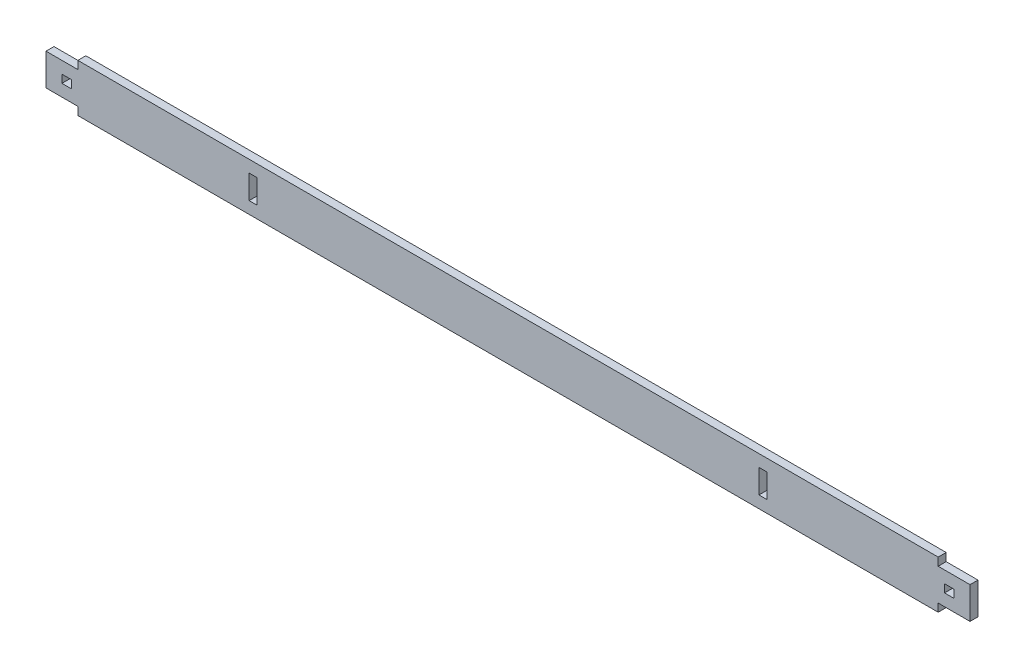
ISO-10303-21;
HEADER;
FILE_DESCRIPTION(('STEP AP214'),'2;1');
FILE_NAME('part.step','',(''),(''),'','','');
FILE_SCHEMA(('AUTOMOTIVE_DESIGN { 1 0 10303 214 1 1 1 1 }'));
ENDSEC;
DATA;
#1=APPLICATION_CONTEXT('core data for automotive mechanical design processes');
#2=APPLICATION_PROTOCOL_DEFINITION('international standard','automotive_design',2000,#1);
#3=PRODUCT_CONTEXT('',#1,'mechanical');
#4=PRODUCT('Part','Part','',(#3));
#5=PRODUCT_RELATED_PRODUCT_CATEGORY('part','',(#4));
#6=PRODUCT_DEFINITION_FORMATION('','',#4);
#7=PRODUCT_DEFINITION_CONTEXT('part definition',#1,'design');
#8=PRODUCT_DEFINITION('design','',#6,#7);
#9=PRODUCT_DEFINITION_SHAPE('','',#8);
#10=(LENGTH_UNIT() NAMED_UNIT(*) SI_UNIT(.MILLI.,.METRE.));
#11=(NAMED_UNIT(*) PLANE_ANGLE_UNIT() SI_UNIT($,.RADIAN.));
#12=(NAMED_UNIT(*) SI_UNIT($,.STERADIAN.) SOLID_ANGLE_UNIT());
#13=UNCERTAINTY_MEASURE_WITH_UNIT(LENGTH_MEASURE(1.E-05),#10,'distance_accuracy_value','');
#14=(GEOMETRIC_REPRESENTATION_CONTEXT(3) GLOBAL_UNCERTAINTY_ASSIGNED_CONTEXT((#13)) GLOBAL_UNIT_ASSIGNED_CONTEXT((#10,
#11,#12)) REPRESENTATION_CONTEXT('',''));
#15=CARTESIAN_POINT('',(0.,0.,0.));
#16=DIRECTION('',(0.,0.,1.));
#17=DIRECTION('',(1.,0.,0.));
#18=AXIS2_PLACEMENT_3D('',#15,#16,#17);
#19=CARTESIAN_POINT('',(0.,0.,6.35));
#20=DIRECTION('',(0.,0.,-1.));
#21=DIRECTION('',(-1.,0.,0.));
#22=AXIS2_PLACEMENT_3D('',#19,#20,#21);
#23=PLANE('',#22);
#24=DIRECTION('',(0.,-1.,0.));
#25=VECTOR('',#24,1.);
#26=CARTESIAN_POINT('',(355.6,3.175,6.35));
#27=LINE('',#26,#25);
#28=CARTESIAN_POINT('',(355.6,3.175,6.35));
#29=VERTEX_POINT('',#28);
#30=CARTESIAN_POINT('',(355.6,-3.175,6.35));
#31=VERTEX_POINT('',#30);
#32=EDGE_CURVE('E338',#29,#31,#27,.T.);
#33=ORIENTED_EDGE('',*,*,#32,.T.);
#34=DIRECTION('',(-1.,0.,0.));
#35=VECTOR('',#34,1.);
#36=CARTESIAN_POINT('',(355.6,-3.175,6.35));
#37=LINE('',#36,#35);
#38=CARTESIAN_POINT('',(347.98,-3.175,6.35));
#39=VERTEX_POINT('',#38);
#40=EDGE_CURVE('E352',#31,#39,#37,.T.);
#41=ORIENTED_EDGE('',*,*,#40,.T.);
#42=DIRECTION('',(0.,1.,0.));
#43=VECTOR('',#42,1.);
#44=CARTESIAN_POINT('',(347.98,3.175,6.35));
#45=LINE('',#44,#43);
#46=CARTESIAN_POINT('',(347.98,3.175,6.35));
#47=VERTEX_POINT('',#46);
#48=EDGE_CURVE('E370',#39,#47,#45,.T.);
#49=ORIENTED_EDGE('',*,*,#48,.T.);
#50=DIRECTION('',(1.,0.,0.));
#51=VECTOR('',#50,1.);
#52=CARTESIAN_POINT('',(355.6,3.175,6.35));
#53=LINE('',#52,#51);
#54=EDGE_CURVE('E366',#47,#29,#53,.T.);
#55=ORIENTED_EDGE('',*,*,#54,.T.);
#56=EDGE_LOOP('',(#33,#41,#49,#55));
#57=FACE_BOUND('',#56,.T.);
#58=DIRECTION('',(0.,1.,0.));
#59=VECTOR('',#58,1.);
#60=CARTESIAN_POINT('',(342.9,-19.05,6.35));
#61=LINE('',#60,#59);
#62=CARTESIAN_POINT('',(342.9,-19.05,6.35));
#63=VERTEX_POINT('',#62);
#64=CARTESIAN_POINT('',(342.9,-12.7,6.35));
#65=VERTEX_POINT('',#64);
#66=EDGE_CURVE('E486',#63,#65,#61,.T.);
#67=ORIENTED_EDGE('',*,*,#66,.T.);
#68=DIRECTION('',(-1.,0.,0.));
#69=VECTOR('',#68,1.);
#70=CARTESIAN_POINT('',(368.3,-12.7,6.35));
#71=LINE('',#70,#69);
#72=CARTESIAN_POINT('',(368.3,-12.7,6.35));
#73=VERTEX_POINT('',#72);
#74=EDGE_CURVE('E399',#73,#65,#71,.T.);
#75=ORIENTED_EDGE('',*,*,#74,.F.);
#76=DIRECTION('',(0.,-1.,0.));
#77=VECTOR('',#76,1.);
#78=CARTESIAN_POINT('',(368.3,-12.7,6.35));
#79=LINE('',#78,#77);
#80=CARTESIAN_POINT('',(368.3,12.7,6.35));
#81=VERTEX_POINT('',#80);
#82=EDGE_CURVE('E394',#81,#73,#79,.T.);
#83=ORIENTED_EDGE('',*,*,#82,.F.);
#84=DIRECTION('',(1.,0.,0.));
#85=VECTOR('',#84,1.);
#86=CARTESIAN_POINT('',(368.3,12.7,6.35));
#87=LINE('',#86,#85);
#88=CARTESIAN_POINT('',(342.9,12.7,6.35));
#89=VERTEX_POINT('',#88);
#90=EDGE_CURVE('E381',#89,#81,#87,.T.);
#91=ORIENTED_EDGE('',*,*,#90,.F.);
#92=CARTESIAN_POINT('',(342.9,19.05,6.35));
#93=VERTEX_POINT('',#92);
#94=EDGE_CURVE('E491',#89,#93,#61,.T.);
#95=ORIENTED_EDGE('',*,*,#94,.T.);
#96=DIRECTION('',(-1.,0.,0.));
#97=VECTOR('',#96,1.);
#98=CARTESIAN_POINT('',(-342.9,19.05,6.35));
#99=LINE('',#98,#97);
#100=CARTESIAN_POINT('',(-342.9,19.05,6.35));
#101=VERTEX_POINT('',#100);
#102=EDGE_CURVE('E490',#93,#101,#99,.T.);
#103=ORIENTED_EDGE('',*,*,#102,.T.);
#104=DIRECTION('',(0.,-1.,0.));
#105=VECTOR('',#104,1.);
#106=CARTESIAN_POINT('',(-342.9,-19.05,6.35));
#107=LINE('',#106,#105);
#108=CARTESIAN_POINT('',(-342.9,12.7,6.35));
#109=VERTEX_POINT('',#108);
#110=EDGE_CURVE('E495',#101,#109,#107,.T.);
#111=ORIENTED_EDGE('',*,*,#110,.T.);
#112=DIRECTION('',(-1.,0.,0.));
#113=VECTOR('',#112,1.);
#114=CARTESIAN_POINT('',(-368.3,12.7,6.35));
#115=LINE('',#114,#113);
#116=CARTESIAN_POINT('',(-368.3,12.7,6.35));
#117=VERTEX_POINT('',#116);
#118=EDGE_CURVE('E453',#109,#117,#115,.T.);
#119=ORIENTED_EDGE('',*,*,#118,.T.);
#120=DIRECTION('',(0.,-1.,0.));
#121=VECTOR('',#120,1.);
#122=CARTESIAN_POINT('',(-368.3,-12.7,6.35));
#123=LINE('',#122,#121);
#124=CARTESIAN_POINT('',(-368.3,-12.7,6.35));
#125=VERTEX_POINT('',#124);
#126=EDGE_CURVE('E464',#117,#125,#123,.T.);
#127=ORIENTED_EDGE('',*,*,#126,.T.);
#128=DIRECTION('',(1.,0.,0.));
#129=VECTOR('',#128,1.);
#130=CARTESIAN_POINT('',(-368.3,-12.7,6.35));
#131=LINE('',#130,#129);
#132=CARTESIAN_POINT('',(-342.9,-12.7,6.35));
#133=VERTEX_POINT('',#132);
#134=EDGE_CURVE('E460',#125,#133,#131,.T.);
#135=ORIENTED_EDGE('',*,*,#134,.T.);
#136=CARTESIAN_POINT('',(-342.9,-19.05,6.35));
#137=VERTEX_POINT('',#136);
#138=EDGE_CURVE('E494',#133,#137,#107,.T.);
#139=ORIENTED_EDGE('',*,*,#138,.T.);
#140=DIRECTION('',(1.,0.,0.));
#141=VECTOR('',#140,1.);
#142=CARTESIAN_POINT('',(-342.9,-19.05,6.35));
#143=LINE('',#142,#141);
#144=EDGE_CURVE('E498',#137,#63,#143,.T.);
#145=ORIENTED_EDGE('',*,*,#144,.T.);
#146=EDGE_LOOP('',(#67,#75,#83,#91,#95,#103,#111,#119,#127,#135,#139,#145));
#147=FACE_BOUND('',#146,.T.);
#148=DIRECTION('',(1.,0.,0.));
#149=VECTOR('',#148,1.);
#150=CARTESIAN_POINT('',(-355.6,-3.175,6.35));
#151=LINE('',#150,#149);
#152=CARTESIAN_POINT('',(-355.6,-3.175,6.35));
#153=VERTEX_POINT('',#152);
#154=CARTESIAN_POINT('',(-347.98,-3.175,6.35));
#155=VERTEX_POINT('',#154);
#156=EDGE_CURVE('E443',#153,#155,#151,.T.);
#157=ORIENTED_EDGE('',*,*,#156,.F.);
#158=DIRECTION('',(0.,-1.,0.));
#159=VECTOR('',#158,1.);
#160=CARTESIAN_POINT('',(-355.6,3.175,6.35));
#161=LINE('',#160,#159);
#162=CARTESIAN_POINT('',(-355.6,3.175,6.35));
#163=VERTEX_POINT('',#162);
#164=EDGE_CURVE('E427',#163,#153,#161,.T.);
#165=ORIENTED_EDGE('',*,*,#164,.F.);
#166=DIRECTION('',(-1.,0.,0.));
#167=VECTOR('',#166,1.);
#168=CARTESIAN_POINT('',(-355.6,3.175,6.35));
#169=LINE('',#168,#167);
#170=CARTESIAN_POINT('',(-347.98,3.175,6.35));
#171=VERTEX_POINT('',#170);
#172=EDGE_CURVE('E432',#171,#163,#169,.T.);
#173=ORIENTED_EDGE('',*,*,#172,.F.);
#174=DIRECTION('',(0.,1.,0.));
#175=VECTOR('',#174,1.);
#176=CARTESIAN_POINT('',(-347.98,3.175,6.35));
#177=LINE('',#176,#175);
#178=EDGE_CURVE('E446',#155,#171,#177,.T.);
#179=ORIENTED_EDGE('',*,*,#178,.F.);
#180=EDGE_LOOP('',(#157,#165,#173,#179));
#181=FACE_BOUND('',#180,.T.);
#182=DIRECTION('',(-1.,0.,0.));
#183=VECTOR('',#182,1.);
#184=CARTESIAN_POINT('',(-206.375,9.52500000000003,6.35));
#185=LINE('',#184,#183);
#186=CARTESIAN_POINT('',(-200.025,9.52500000000003,6.35));
#187=VERTEX_POINT('',#186);
#188=CARTESIAN_POINT('',(-206.375,9.52500000000003,6.35));
#189=VERTEX_POINT('',#188);
#190=EDGE_CURVE('E324',#187,#189,#185,.T.);
#191=ORIENTED_EDGE('',*,*,#190,.F.);
#192=DIRECTION('',(0.,1.,0.));
#193=VECTOR('',#192,1.);
#194=CARTESIAN_POINT('',(-200.025,9.52500000000003,6.35));
#195=LINE('',#194,#193);
#196=CARTESIAN_POINT('',(-200.025,-9.52499999999998,6.35));
#197=VERTEX_POINT('',#196);
#198=EDGE_CURVE('E298',#197,#187,#195,.T.);
#199=ORIENTED_EDGE('',*,*,#198,.F.);
#200=DIRECTION('',(1.,0.,0.));
#201=VECTOR('',#200,1.);
#202=CARTESIAN_POINT('',(-206.375,-9.52499999999998,6.35));
#203=LINE('',#202,#201);
#204=CARTESIAN_POINT('',(-206.375,-9.52499999999998,6.35));
#205=VERTEX_POINT('',#204);
#206=EDGE_CURVE('E309',#205,#197,#203,.T.);
#207=ORIENTED_EDGE('',*,*,#206,.F.);
#208=DIRECTION('',(0.,-1.,0.));
#209=VECTOR('',#208,1.);
#210=CARTESIAN_POINT('',(-206.375,9.52500000000003,6.35));
#211=LINE('',#210,#209);
#212=EDGE_CURVE('E328',#189,#205,#211,.T.);
#213=ORIENTED_EDGE('',*,*,#212,.F.);
#214=EDGE_LOOP('',(#191,#199,#207,#213));
#215=FACE_BOUND('',#214,.T.);
#216=DIRECTION('',(0.,1.,0.));
#217=VECTOR('',#216,1.);
#218=CARTESIAN_POINT('',(200.025,9.52500000000003,6.35));
#219=LINE('',#218,#217);
#220=CARTESIAN_POINT('',(200.025,-9.52499999999998,6.35));
#221=VERTEX_POINT('',#220);
#222=CARTESIAN_POINT('',(200.025,9.52500000000003,6.35));
#223=VERTEX_POINT('',#222);
#224=EDGE_CURVE('E57',#221,#223,#219,.T.);
#225=ORIENTED_EDGE('',*,*,#224,.T.);
#226=DIRECTION('',(1.,0.,0.));
#227=VECTOR('',#226,1.);
#228=CARTESIAN_POINT('',(206.375,9.52500000000003,6.35));
#229=LINE('',#228,#227);
#230=CARTESIAN_POINT('',(206.375,9.52500000000003,6.35));
#231=VERTEX_POINT('',#230);
#232=EDGE_CURVE('E277',#223,#231,#229,.T.);
#233=ORIENTED_EDGE('',*,*,#232,.T.);
#234=DIRECTION('',(0.,-1.,0.));
#235=VECTOR('',#234,1.);
#236=CARTESIAN_POINT('',(206.375,9.52500000000003,6.35));
#237=LINE('',#236,#235);
#238=CARTESIAN_POINT('',(206.375,-9.52499999999998,6.35));
#239=VERTEX_POINT('',#238);
#240=EDGE_CURVE('E281',#231,#239,#237,.T.);
#241=ORIENTED_EDGE('',*,*,#240,.T.);
#242=DIRECTION('',(-1.,0.,0.));
#243=VECTOR('',#242,1.);
#244=CARTESIAN_POINT('',(206.375,-9.52499999999998,6.35));
#245=LINE('',#244,#243);
#246=EDGE_CURVE('E289',#239,#221,#245,.T.);
#247=ORIENTED_EDGE('',*,*,#246,.T.);
#248=EDGE_LOOP('',(#225,#233,#241,#247));
#249=FACE_BOUND('',#248,.T.);
#250=ADVANCED_FACE('F38',(#57,#147,#181,#215,#249),#23,.F.);
#251=CARTESIAN_POINT('',(0.,0.,0.));
#252=DIRECTION('',(0.,0.,-1.));
#253=DIRECTION('',(-1.,0.,0.));
#254=AXIS2_PLACEMENT_3D('',#251,#252,#253);
#255=PLANE('',#254);
#256=DIRECTION('',(-1.,0.,0.));
#257=VECTOR('',#256,1.);
#258=CARTESIAN_POINT('',(355.6,-3.175,0.));
#259=LINE('',#258,#257);
#260=CARTESIAN_POINT('',(355.6,-3.175,0.));
#261=VERTEX_POINT('',#260);
#262=CARTESIAN_POINT('',(347.98,-3.175,0.));
#263=VERTEX_POINT('',#262);
#264=EDGE_CURVE('E359',#261,#263,#259,.T.);
#265=ORIENTED_EDGE('',*,*,#264,.F.);
#266=DIRECTION('',(0.,-1.,0.));
#267=VECTOR('',#266,1.);
#268=CARTESIAN_POINT('',(355.6,3.175,0.));
#269=LINE('',#268,#267);
#270=CARTESIAN_POINT('',(355.6,3.175,0.));
#271=VERTEX_POINT('',#270);
#272=EDGE_CURVE('E348',#271,#261,#269,.T.);
#273=ORIENTED_EDGE('',*,*,#272,.F.);
#274=DIRECTION('',(1.,0.,0.));
#275=VECTOR('',#274,1.);
#276=CARTESIAN_POINT('',(355.6,3.175,0.));
#277=LINE('',#276,#275);
#278=CARTESIAN_POINT('',(347.98,3.175,0.));
#279=VERTEX_POINT('',#278);
#280=EDGE_CURVE('E351',#279,#271,#277,.T.);
#281=ORIENTED_EDGE('',*,*,#280,.F.);
#282=DIRECTION('',(0.,1.,0.));
#283=VECTOR('',#282,1.);
#284=CARTESIAN_POINT('',(347.98,3.175,0.));
#285=LINE('',#284,#283);
#286=EDGE_CURVE('E355',#263,#279,#285,.T.);
#287=ORIENTED_EDGE('',*,*,#286,.F.);
#288=EDGE_LOOP('',(#265,#273,#281,#287));
#289=FACE_BOUND('',#288,.T.);
#290=DIRECTION('',(0.,1.,0.));
#291=VECTOR('',#290,1.);
#292=CARTESIAN_POINT('',(342.9,-19.05,0.));
#293=LINE('',#292,#291);
#294=CARTESIAN_POINT('',(342.9,12.7,0.));
#295=VERTEX_POINT('',#294);
#296=CARTESIAN_POINT('',(342.9,19.05,0.));
#297=VERTEX_POINT('',#296);
#298=EDGE_CURVE('E485',#295,#297,#293,.T.);
#299=ORIENTED_EDGE('',*,*,#298,.F.);
#300=DIRECTION('',(1.,0.,0.));
#301=VECTOR('',#300,1.);
#302=CARTESIAN_POINT('',(368.3,12.7,0.));
#303=LINE('',#302,#301);
#304=CARTESIAN_POINT('',(368.3,12.7,0.));
#305=VERTEX_POINT('',#304);
#306=EDGE_CURVE('E409',#295,#305,#303,.T.);
#307=ORIENTED_EDGE('',*,*,#306,.T.);
#308=DIRECTION('',(0.,-1.,0.));
#309=VECTOR('',#308,1.);
#310=CARTESIAN_POINT('',(368.3,-12.7,0.));
#311=LINE('',#310,#309);
#312=CARTESIAN_POINT('',(368.3,-12.7,0.));
#313=VERTEX_POINT('',#312);
#314=EDGE_CURVE('E404',#305,#313,#311,.T.);
#315=ORIENTED_EDGE('',*,*,#314,.T.);
#316=DIRECTION('',(-1.,0.,0.));
#317=VECTOR('',#316,1.);
#318=CARTESIAN_POINT('',(368.3,-12.7,0.));
#319=LINE('',#318,#317);
#320=CARTESIAN_POINT('',(342.9,-12.7,0.));
#321=VERTEX_POINT('',#320);
#322=EDGE_CURVE('E403',#313,#321,#319,.T.);
#323=ORIENTED_EDGE('',*,*,#322,.T.);
#324=CARTESIAN_POINT('',(342.9,-19.05,0.));
#325=VERTEX_POINT('',#324);
#326=EDGE_CURVE('E502',#325,#321,#293,.T.);
#327=ORIENTED_EDGE('',*,*,#326,.F.);
#328=DIRECTION('',(1.,0.,0.));
#329=VECTOR('',#328,1.);
#330=CARTESIAN_POINT('',(-342.9,-19.05,0.));
#331=LINE('',#330,#329);
#332=CARTESIAN_POINT('',(-342.9,-19.05,0.));
#333=VERTEX_POINT('',#332);
#334=EDGE_CURVE('E512',#333,#325,#331,.T.);
#335=ORIENTED_EDGE('',*,*,#334,.F.);
#336=DIRECTION('',(0.,-1.,0.));
#337=VECTOR('',#336,1.);
#338=CARTESIAN_POINT('',(-342.9,-19.05,0.));
#339=LINE('',#338,#337);
#340=CARTESIAN_POINT('',(-342.9,-12.7,0.));
#341=VERTEX_POINT('',#340);
#342=EDGE_CURVE('E508',#341,#333,#339,.T.);
#343=ORIENTED_EDGE('',*,*,#342,.F.);
#344=DIRECTION('',(1.,0.,0.));
#345=VECTOR('',#344,1.);
#346=CARTESIAN_POINT('',(-368.3,-12.7,0.));
#347=LINE('',#346,#345);
#348=CARTESIAN_POINT('',(-368.3,-12.7,0.));
#349=VERTEX_POINT('',#348);
#350=EDGE_CURVE('E470',#349,#341,#347,.T.);
#351=ORIENTED_EDGE('',*,*,#350,.F.);
#352=DIRECTION('',(0.,-1.,0.));
#353=VECTOR('',#352,1.);
#354=CARTESIAN_POINT('',(-368.3,-12.7,0.));
#355=LINE('',#354,#353);
#356=CARTESIAN_POINT('',(-368.3,12.7,0.));
#357=VERTEX_POINT('',#356);
#358=EDGE_CURVE('E474',#357,#349,#355,.T.);
#359=ORIENTED_EDGE('',*,*,#358,.F.);
#360=DIRECTION('',(-1.,0.,0.));
#361=VECTOR('',#360,1.);
#362=CARTESIAN_POINT('',(-368.3,12.7,0.));
#363=LINE('',#362,#361);
#364=CARTESIAN_POINT('',(-342.9,12.7,0.));
#365=VERTEX_POINT('',#364);
#366=EDGE_CURVE('E463',#365,#357,#363,.T.);
#367=ORIENTED_EDGE('',*,*,#366,.F.);
#368=CARTESIAN_POINT('',(-342.9,19.05,0.));
#369=VERTEX_POINT('',#368);
#370=EDGE_CURVE('E509',#369,#365,#339,.T.);
#371=ORIENTED_EDGE('',*,*,#370,.F.);
#372=DIRECTION('',(-1.,0.,0.));
#373=VECTOR('',#372,1.);
#374=CARTESIAN_POINT('',(-342.9,19.05,0.));
#375=LINE('',#374,#373);
#376=EDGE_CURVE('E505',#297,#369,#375,.T.);
#377=ORIENTED_EDGE('',*,*,#376,.F.);
#378=EDGE_LOOP('',(#299,#307,#315,#323,#327,#335,#343,#351,#359,#367,#371,#377));
#379=FACE_BOUND('',#378,.T.);
#380=DIRECTION('',(0.,-1.,0.));
#381=VECTOR('',#380,1.);
#382=CARTESIAN_POINT('',(-355.6,3.175,0.));
#383=LINE('',#382,#381);
#384=CARTESIAN_POINT('',(-355.6,3.175,0.));
#385=VERTEX_POINT('',#384);
#386=CARTESIAN_POINT('',(-355.6,-3.175,0.));
#387=VERTEX_POINT('',#386);
#388=EDGE_CURVE('E428',#385,#387,#383,.T.);
#389=ORIENTED_EDGE('',*,*,#388,.T.);
#390=DIRECTION('',(1.,0.,0.));
#391=VECTOR('',#390,1.);
#392=CARTESIAN_POINT('',(-355.6,-3.175,0.));
#393=LINE('',#392,#391);
#394=CARTESIAN_POINT('',(-347.98,-3.175,0.));
#395=VERTEX_POINT('',#394);
#396=EDGE_CURVE('E431',#387,#395,#393,.T.);
#397=ORIENTED_EDGE('',*,*,#396,.T.);
#398=DIRECTION('',(0.,1.,0.));
#399=VECTOR('',#398,1.);
#400=CARTESIAN_POINT('',(-347.98,3.175,0.));
#401=LINE('',#400,#399);
#402=CARTESIAN_POINT('',(-347.98,3.175,0.));
#403=VERTEX_POINT('',#402);
#404=EDGE_CURVE('E435',#395,#403,#401,.T.);
#405=ORIENTED_EDGE('',*,*,#404,.T.);
#406=DIRECTION('',(-1.,0.,0.));
#407=VECTOR('',#406,1.);
#408=CARTESIAN_POINT('',(-355.6,3.175,0.));
#409=LINE('',#408,#407);
#410=EDGE_CURVE('E438',#403,#385,#409,.T.);
#411=ORIENTED_EDGE('',*,*,#410,.T.);
#412=EDGE_LOOP('',(#389,#397,#405,#411));
#413=FACE_BOUND('',#412,.T.);
#414=DIRECTION('',(0.,1.,0.));
#415=VECTOR('',#414,1.);
#416=CARTESIAN_POINT('',(-200.025,9.52500000000003,0.));
#417=LINE('',#416,#415);
#418=CARTESIAN_POINT('',(-200.025,-9.52499999999998,0.));
#419=VERTEX_POINT('',#418);
#420=CARTESIAN_POINT('',(-200.025,9.52500000000003,0.));
#421=VERTEX_POINT('',#420);
#422=EDGE_CURVE('E304',#419,#421,#417,.T.);
#423=ORIENTED_EDGE('',*,*,#422,.T.);
#424=DIRECTION('',(-1.,0.,0.));
#425=VECTOR('',#424,1.);
#426=CARTESIAN_POINT('',(-206.375,9.52500000000003,0.));
#427=LINE('',#426,#425);
#428=CARTESIAN_POINT('',(-206.375,9.52500000000003,0.));
#429=VERTEX_POINT('',#428);
#430=EDGE_CURVE('E308',#421,#429,#427,.T.);
#431=ORIENTED_EDGE('',*,*,#430,.T.);
#432=DIRECTION('',(0.,-1.,0.));
#433=VECTOR('',#432,1.);
#434=CARTESIAN_POINT('',(-206.375,9.52500000000003,0.));
#435=LINE('',#434,#433);
#436=CARTESIAN_POINT('',(-206.375,-9.52499999999998,0.));
#437=VERTEX_POINT('',#436);
#438=EDGE_CURVE('E313',#429,#437,#435,.T.);
#439=ORIENTED_EDGE('',*,*,#438,.T.);
#440=DIRECTION('',(1.,0.,0.));
#441=VECTOR('',#440,1.);
#442=CARTESIAN_POINT('',(-206.375,-9.52499999999998,0.));
#443=LINE('',#442,#441);
#444=EDGE_CURVE('E317',#437,#419,#443,.T.);
#445=ORIENTED_EDGE('',*,*,#444,.T.);
#446=EDGE_LOOP('',(#423,#431,#439,#445));
#447=FACE_BOUND('',#446,.T.);
#448=DIRECTION('',(1.,0.,0.));
#449=VECTOR('',#448,1.);
#450=CARTESIAN_POINT('',(206.375,9.52500000000003,0.));
#451=LINE('',#450,#449);
#452=CARTESIAN_POINT('',(200.025,9.52500000000003,0.));
#453=VERTEX_POINT('',#452);
#454=CARTESIAN_POINT('',(206.375,9.52500000000003,0.));
#455=VERTEX_POINT('',#454);
#456=EDGE_CURVE('E272',#453,#455,#451,.T.);
#457=ORIENTED_EDGE('',*,*,#456,.F.);
#458=DIRECTION('',(0.,1.,0.));
#459=VECTOR('',#458,1.);
#460=CARTESIAN_POINT('',(200.025,9.52500000000003,0.));
#461=LINE('',#460,#459);
#462=CARTESIAN_POINT('',(200.025,-9.52499999999998,0.));
#463=VERTEX_POINT('',#462);
#464=EDGE_CURVE('E267',#463,#453,#461,.T.);
#465=ORIENTED_EDGE('',*,*,#464,.F.);
#466=DIRECTION('',(-1.,0.,0.));
#467=VECTOR('',#466,1.);
#468=CARTESIAN_POINT('',(206.375,-9.52499999999998,0.));
#469=LINE('',#468,#467);
#470=CARTESIAN_POINT('',(206.375,-9.52499999999998,0.));
#471=VERTEX_POINT('',#470);
#472=EDGE_CURVE('E258',#471,#463,#469,.T.);
#473=ORIENTED_EDGE('',*,*,#472,.F.);
#474=DIRECTION('',(0.,-1.,0.));
#475=VECTOR('',#474,1.);
#476=CARTESIAN_POINT('',(206.375,9.52500000000003,0.));
#477=LINE('',#476,#475);
#478=EDGE_CURVE('E266',#455,#471,#477,.T.);
#479=ORIENTED_EDGE('',*,*,#478,.F.);
#480=EDGE_LOOP('',(#457,#465,#473,#479));
#481=FACE_BOUND('',#480,.T.);
#482=ADVANCED_FACE('F275',(#289,#379,#413,#447,#481),#255,.T.);
#483=CARTESIAN_POINT('',(342.9,-19.05,6.35));
#484=DIRECTION('',(-1.,0.,0.));
#485=DIRECTION('',(0.,0.,1.));
#486=AXIS2_PLACEMENT_3D('',#483,#484,#485);
#487=PLANE('',#486);
#488=DIRECTION('',(0.,0.,1.));
#489=VECTOR('',#488,1.);
#490=CARTESIAN_POINT('',(342.9,12.7,6.35));
#491=LINE('',#490,#489);
#492=EDGE_CURVE('E423',#295,#89,#491,.T.);
#493=ORIENTED_EDGE('',*,*,#492,.F.);
#494=ORIENTED_EDGE('',*,*,#298,.T.);
#495=DIRECTION('',(0.,0.,-1.));
#496=VECTOR('',#495,1.);
#497=CARTESIAN_POINT('',(342.9,19.05,6.35));
#498=LINE('',#497,#496);
#499=EDGE_CURVE('E11',#93,#297,#498,.T.);
#500=ORIENTED_EDGE('',*,*,#499,.F.);
#501=ORIENTED_EDGE('',*,*,#94,.F.);
#502=EDGE_LOOP('',(#493,#494,#500,#501));
#503=FACE_BOUND('',#502,.T.);
#504=ADVANCED_FACE('F40',(#503),#487,.F.);
#505=DIRECTION('',(0.,0.,-1.));
#506=VECTOR('',#505,1.);
#507=CARTESIAN_POINT('',(342.9,-12.7,6.35));
#508=LINE('',#507,#506);
#509=EDGE_CURVE('E408',#65,#321,#508,.T.);
#510=ORIENTED_EDGE('',*,*,#509,.F.);
#511=ORIENTED_EDGE('',*,*,#66,.F.);
#512=DIRECTION('',(0.,0.,-1.));
#513=VECTOR('',#512,1.);
#514=CARTESIAN_POINT('',(342.9,-19.05,6.35));
#515=LINE('',#514,#513);
#516=EDGE_CURVE('E501',#63,#325,#515,.T.);
#517=ORIENTED_EDGE('',*,*,#516,.T.);
#518=ORIENTED_EDGE('',*,*,#326,.T.);
#519=EDGE_LOOP('',(#510,#511,#517,#518));
#520=FACE_BOUND('',#519,.T.);
#521=ADVANCED_FACE('F563',(#520),#487,.F.);
#522=CARTESIAN_POINT('',(-342.9,-19.05,6.35));
#523=DIRECTION('',(1.,0.,0.));
#524=DIRECTION('',(0.,0.,-1.));
#525=AXIS2_PLACEMENT_3D('',#522,#523,#524);
#526=PLANE('',#525);
#527=ORIENTED_EDGE('',*,*,#370,.T.);
#528=DIRECTION('',(0.,0.,1.));
#529=VECTOR('',#528,1.);
#530=CARTESIAN_POINT('',(-342.9,12.7,6.35));
#531=LINE('',#530,#529);
#532=EDGE_CURVE('E482',#365,#109,#531,.T.);
#533=ORIENTED_EDGE('',*,*,#532,.T.);
#534=ORIENTED_EDGE('',*,*,#110,.F.);
#535=DIRECTION('',(0.,0.,-1.));
#536=VECTOR('',#535,1.);
#537=CARTESIAN_POINT('',(-342.9,19.05,6.35));
#538=LINE('',#537,#536);
#539=EDGE_CURVE('E47',#101,#369,#538,.T.);
#540=ORIENTED_EDGE('',*,*,#539,.T.);
#541=EDGE_LOOP('',(#527,#533,#534,#540));
#542=FACE_BOUND('',#541,.T.);
#543=ADVANCED_FACE('F525',(#542),#526,.F.);
#544=CARTESIAN_POINT('',(-342.9,19.05,6.35));
#545=DIRECTION('',(0.,-1.,0.));
#546=DIRECTION('',(0.,0.,-1.));
#547=AXIS2_PLACEMENT_3D('',#544,#545,#546);
#548=PLANE('',#547);
#549=ORIENTED_EDGE('',*,*,#376,.T.);
#550=ORIENTED_EDGE('',*,*,#539,.F.);
#551=ORIENTED_EDGE('',*,*,#102,.F.);
#552=ORIENTED_EDGE('',*,*,#499,.T.);
#553=EDGE_LOOP('',(#549,#550,#551,#552));
#554=FACE_BOUND('',#553,.T.);
#555=ADVANCED_FACE('F541',(#554),#548,.F.);
#556=ORIENTED_EDGE('',*,*,#138,.F.);
#557=DIRECTION('',(0.,0.,-1.));
#558=VECTOR('',#557,1.);
#559=CARTESIAN_POINT('',(-342.9,-12.7,6.35));
#560=LINE('',#559,#558);
#561=EDGE_CURVE('E472',#133,#341,#560,.T.);
#562=ORIENTED_EDGE('',*,*,#561,.T.);
#563=ORIENTED_EDGE('',*,*,#342,.T.);
#564=DIRECTION('',(0.,0.,-1.));
#565=VECTOR('',#564,1.);
#566=CARTESIAN_POINT('',(-342.9,-19.05,6.35));
#567=LINE('',#566,#565);
#568=EDGE_CURVE('E518',#137,#333,#567,.T.);
#569=ORIENTED_EDGE('',*,*,#568,.F.);
#570=EDGE_LOOP('',(#556,#562,#563,#569));
#571=FACE_BOUND('',#570,.T.);
#572=ADVANCED_FACE('F571',(#571),#526,.F.);
#573=CARTESIAN_POINT('',(-342.9,-19.05,6.35));
#574=DIRECTION('',(0.,1.,0.));
#575=DIRECTION('',(0.,0.,1.));
#576=AXIS2_PLACEMENT_3D('',#573,#574,#575);
#577=PLANE('',#576);
#578=ORIENTED_EDGE('',*,*,#334,.T.);
#579=ORIENTED_EDGE('',*,*,#516,.F.);
#580=ORIENTED_EDGE('',*,*,#144,.F.);
#581=ORIENTED_EDGE('',*,*,#568,.T.);
#582=EDGE_LOOP('',(#578,#579,#580,#581));
#583=FACE_BOUND('',#582,.T.);
#584=ADVANCED_FACE('F567',(#583),#577,.F.);
#585=CARTESIAN_POINT('',(-368.3,12.7,-56.7961266284947));
#586=DIRECTION('',(0.,1.,0.));
#587=DIRECTION('',(-1.,0.,0.));
#588=AXIS2_PLACEMENT_3D('',#585,#586,#587);
#589=PLANE('',#588);
#590=ORIENTED_EDGE('',*,*,#532,.F.);
#591=ORIENTED_EDGE('',*,*,#366,.T.);
#592=DIRECTION('',(0.,0.,1.));
#593=VECTOR('',#592,1.);
#594=CARTESIAN_POINT('',(-368.3,12.7,-56.7961266284947));
#595=LINE('',#594,#593);
#596=EDGE_CURVE('E469',#357,#117,#595,.T.);
#597=ORIENTED_EDGE('',*,*,#596,.T.);
#598=ORIENTED_EDGE('',*,*,#118,.F.);
#599=EDGE_LOOP('',(#590,#591,#597,#598));
#600=FACE_BOUND('',#599,.T.);
#601=ADVANCED_FACE('F535',(#600),#589,.T.);
#602=CARTESIAN_POINT('',(-368.3,-12.7,-56.7961266284947));
#603=DIRECTION('',(0.,-1.,0.));
#604=DIRECTION('',(1.,0.,0.));
#605=AXIS2_PLACEMENT_3D('',#602,#603,#604);
#606=PLANE('',#605);
#607=ORIENTED_EDGE('',*,*,#561,.F.);
#608=ORIENTED_EDGE('',*,*,#134,.F.);
#609=DIRECTION('',(0.,0.,1.));
#610=VECTOR('',#609,1.);
#611=CARTESIAN_POINT('',(-368.3,-12.7,-56.7961266284947));
#612=LINE('',#611,#610);
#613=EDGE_CURVE('E473',#349,#125,#612,.T.);
#614=ORIENTED_EDGE('',*,*,#613,.F.);
#615=ORIENTED_EDGE('',*,*,#350,.T.);
#616=EDGE_LOOP('',(#607,#608,#614,#615));
#617=FACE_BOUND('',#616,.T.);
#618=ADVANCED_FACE('F575',(#617),#606,.T.);
#619=CARTESIAN_POINT('',(-368.3,-12.7,-56.7961266284947));
#620=DIRECTION('',(-1.,0.,0.));
#621=DIRECTION('',(0.,0.,1.));
#622=AXIS2_PLACEMENT_3D('',#619,#620,#621);
#623=PLANE('',#622);
#624=ORIENTED_EDGE('',*,*,#596,.F.);
#625=ORIENTED_EDGE('',*,*,#358,.T.);
#626=ORIENTED_EDGE('',*,*,#613,.T.);
#627=ORIENTED_EDGE('',*,*,#126,.F.);
#628=EDGE_LOOP('',(#624,#625,#626,#627));
#629=FACE_BOUND('',#628,.T.);
#630=ADVANCED_FACE('F577',(#629),#623,.T.);
#631=CARTESIAN_POINT('',(-355.6,3.175,0.));
#632=DIRECTION('',(-1.,0.,0.));
#633=DIRECTION('',(0.,0.,1.));
#634=AXIS2_PLACEMENT_3D('',#631,#632,#633);
#635=PLANE('',#634);
#636=ORIENTED_EDGE('',*,*,#164,.T.);
#637=DIRECTION('',(0.,0.,1.));
#638=VECTOR('',#637,1.);
#639=CARTESIAN_POINT('',(-355.6,-3.175,0.));
#640=LINE('',#639,#638);
#641=EDGE_CURVE('E441',#387,#153,#640,.T.);
#642=ORIENTED_EDGE('',*,*,#641,.F.);
#643=ORIENTED_EDGE('',*,*,#388,.F.);
#644=DIRECTION('',(0.,0.,1.));
#645=VECTOR('',#644,1.);
#646=CARTESIAN_POINT('',(-355.6,3.175,0.));
#647=LINE('',#646,#645);
#648=EDGE_CURVE('E451',#385,#163,#647,.T.);
#649=ORIENTED_EDGE('',*,*,#648,.T.);
#650=EDGE_LOOP('',(#636,#642,#643,#649));
#651=FACE_BOUND('',#650,.T.);
#652=ADVANCED_FACE('F579',(#651),#635,.F.);
#653=CARTESIAN_POINT('',(-355.6,3.175,0.));
#654=DIRECTION('',(0.,1.,0.));
#655=DIRECTION('',(0.,0.,1.));
#656=AXIS2_PLACEMENT_3D('',#653,#654,#655);
#657=PLANE('',#656);
#658=ORIENTED_EDGE('',*,*,#172,.T.);
#659=ORIENTED_EDGE('',*,*,#648,.F.);
#660=ORIENTED_EDGE('',*,*,#410,.F.);
#661=DIRECTION('',(0.,0.,1.));
#662=VECTOR('',#661,1.);
#663=CARTESIAN_POINT('',(-347.98,3.175,0.));
#664=LINE('',#663,#662);
#665=EDGE_CURVE('E454',#403,#171,#664,.T.);
#666=ORIENTED_EDGE('',*,*,#665,.T.);
#667=EDGE_LOOP('',(#658,#659,#660,#666));
#668=FACE_BOUND('',#667,.T.);
#669=ADVANCED_FACE('F585',(#668),#657,.F.);
#670=CARTESIAN_POINT('',(-347.98,3.175,0.));
#671=DIRECTION('',(1.,0.,0.));
#672=DIRECTION('',(0.,0.,-1.));
#673=AXIS2_PLACEMENT_3D('',#670,#671,#672);
#674=PLANE('',#673);
#675=ORIENTED_EDGE('',*,*,#178,.T.);
#676=ORIENTED_EDGE('',*,*,#665,.F.);
#677=ORIENTED_EDGE('',*,*,#404,.F.);
#678=DIRECTION('',(0.,0.,1.));
#679=VECTOR('',#678,1.);
#680=CARTESIAN_POINT('',(-347.98,-3.175,0.));
#681=LINE('',#680,#679);
#682=EDGE_CURVE('E456',#395,#155,#681,.T.);
#683=ORIENTED_EDGE('',*,*,#682,.T.);
#684=EDGE_LOOP('',(#675,#676,#677,#683));
#685=FACE_BOUND('',#684,.T.);
#686=ADVANCED_FACE('F785',(#685),#674,.F.);
#687=CARTESIAN_POINT('',(-355.6,-3.175,0.));
#688=DIRECTION('',(0.,-1.,0.));
#689=DIRECTION('',(0.,0.,-1.));
#690=AXIS2_PLACEMENT_3D('',#687,#688,#689);
#691=PLANE('',#690);
#692=ORIENTED_EDGE('',*,*,#156,.T.);
#693=ORIENTED_EDGE('',*,*,#682,.F.);
#694=ORIENTED_EDGE('',*,*,#396,.F.);
#695=ORIENTED_EDGE('',*,*,#641,.T.);
#696=EDGE_LOOP('',(#692,#693,#694,#695));
#697=FACE_BOUND('',#696,.T.);
#698=ADVANCED_FACE('F620',(#697),#691,.F.);
#699=CARTESIAN_POINT('',(368.3,12.7,-56.7961266284947));
#700=DIRECTION('',(0.,-1.,0.));
#701=DIRECTION('',(1.,0.,0.));
#702=AXIS2_PLACEMENT_3D('',#699,#700,#701);
#703=PLANE('',#702);
#704=ORIENTED_EDGE('',*,*,#306,.F.);
#705=ORIENTED_EDGE('',*,*,#492,.T.);
#706=ORIENTED_EDGE('',*,*,#90,.T.);
#707=DIRECTION('',(0.,0.,1.));
#708=VECTOR('',#707,1.);
#709=CARTESIAN_POINT('',(368.3,12.7,-56.7961266284947));
#710=LINE('',#709,#708);
#711=EDGE_CURVE('E393',#305,#81,#710,.T.);
#712=ORIENTED_EDGE('',*,*,#711,.F.);
#713=EDGE_LOOP('',(#704,#705,#706,#712));
#714=FACE_BOUND('',#713,.T.);
#715=ADVANCED_FACE('F554',(#714),#703,.F.);
#716=CARTESIAN_POINT('',(368.3,-12.7,-56.7961266284947));
#717=DIRECTION('',(0.,1.,0.));
#718=DIRECTION('',(-1.,0.,0.));
#719=AXIS2_PLACEMENT_3D('',#716,#717,#718);
#720=PLANE('',#719);
#721=ORIENTED_EDGE('',*,*,#74,.T.);
#722=ORIENTED_EDGE('',*,*,#509,.T.);
#723=ORIENTED_EDGE('',*,*,#322,.F.);
#724=DIRECTION('',(0.,0.,1.));
#725=VECTOR('',#724,1.);
#726=CARTESIAN_POINT('',(368.3,-12.7,-56.7961266284947));
#727=LINE('',#726,#725);
#728=EDGE_CURVE('E398',#313,#73,#727,.T.);
#729=ORIENTED_EDGE('',*,*,#728,.T.);
#730=EDGE_LOOP('',(#721,#722,#723,#729));
#731=FACE_BOUND('',#730,.T.);
#732=ADVANCED_FACE('F558',(#731),#720,.F.);
#733=CARTESIAN_POINT('',(368.3,-12.7,-56.7961266284947));
#734=DIRECTION('',(-1.,0.,0.));
#735=DIRECTION('',(0.,0.,1.));
#736=AXIS2_PLACEMENT_3D('',#733,#734,#735);
#737=PLANE('',#736);
#738=ORIENTED_EDGE('',*,*,#314,.F.);
#739=ORIENTED_EDGE('',*,*,#711,.T.);
#740=ORIENTED_EDGE('',*,*,#82,.T.);
#741=ORIENTED_EDGE('',*,*,#728,.F.);
#742=EDGE_LOOP('',(#738,#739,#740,#741));
#743=FACE_BOUND('',#742,.T.);
#744=ADVANCED_FACE('F551',(#743),#737,.F.);
#745=CARTESIAN_POINT('',(355.6,3.175,0.));
#746=DIRECTION('',(-1.,0.,0.));
#747=DIRECTION('',(0.,0.,1.));
#748=AXIS2_PLACEMENT_3D('',#745,#746,#747);
#749=PLANE('',#748);
#750=ORIENTED_EDGE('',*,*,#32,.F.);
#751=DIRECTION('',(0.,0.,1.));
#752=VECTOR('',#751,1.);
#753=CARTESIAN_POINT('',(355.6,3.175,0.));
#754=LINE('',#753,#752);
#755=EDGE_CURVE('E362',#271,#29,#754,.T.);
#756=ORIENTED_EDGE('',*,*,#755,.F.);
#757=ORIENTED_EDGE('',*,*,#272,.T.);
#758=DIRECTION('',(0.,0.,1.));
#759=VECTOR('',#758,1.);
#760=CARTESIAN_POINT('',(355.6,-3.175,0.));
#761=LINE('',#760,#759);
#762=EDGE_CURVE('E377',#261,#31,#761,.T.);
#763=ORIENTED_EDGE('',*,*,#762,.T.);
#764=EDGE_LOOP('',(#750,#756,#757,#763));
#765=FACE_BOUND('',#764,.T.);
#766=ADVANCED_FACE('F648',(#765),#749,.T.);
#767=CARTESIAN_POINT('',(355.6,-3.175,0.));
#768=DIRECTION('',(0.,1.,0.));
#769=DIRECTION('',(0.,0.,1.));
#770=AXIS2_PLACEMENT_3D('',#767,#768,#769);
#771=PLANE('',#770);
#772=ORIENTED_EDGE('',*,*,#40,.F.);
#773=ORIENTED_EDGE('',*,*,#762,.F.);
#774=ORIENTED_EDGE('',*,*,#264,.T.);
#775=DIRECTION('',(0.,0.,1.));
#776=VECTOR('',#775,1.);
#777=CARTESIAN_POINT('',(347.98,-3.175,0.));
#778=LINE('',#777,#776);
#779=EDGE_CURVE('E382',#263,#39,#778,.T.);
#780=ORIENTED_EDGE('',*,*,#779,.T.);
#781=EDGE_LOOP('',(#772,#773,#774,#780));
#782=FACE_BOUND('',#781,.T.);
#783=ADVANCED_FACE('F657',(#782),#771,.T.);
#784=CARTESIAN_POINT('',(347.98,3.175,0.));
#785=DIRECTION('',(1.,0.,0.));
#786=DIRECTION('',(0.,0.,-1.));
#787=AXIS2_PLACEMENT_3D('',#784,#785,#786);
#788=PLANE('',#787);
#789=ORIENTED_EDGE('',*,*,#48,.F.);
#790=ORIENTED_EDGE('',*,*,#779,.F.);
#791=ORIENTED_EDGE('',*,*,#286,.T.);
#792=DIRECTION('',(0.,0.,1.));
#793=VECTOR('',#792,1.);
#794=CARTESIAN_POINT('',(347.98,3.175,0.));
#795=LINE('',#794,#793);
#796=EDGE_CURVE('E385',#279,#47,#795,.T.);
#797=ORIENTED_EDGE('',*,*,#796,.T.);
#798=EDGE_LOOP('',(#789,#790,#791,#797));
#799=FACE_BOUND('',#798,.T.);
#800=ADVANCED_FACE('F667',(#799),#788,.T.);
#801=CARTESIAN_POINT('',(355.6,3.175,0.));
#802=DIRECTION('',(0.,-1.,0.));
#803=DIRECTION('',(0.,0.,-1.));
#804=AXIS2_PLACEMENT_3D('',#801,#802,#803);
#805=PLANE('',#804);
#806=ORIENTED_EDGE('',*,*,#54,.F.);
#807=ORIENTED_EDGE('',*,*,#796,.F.);
#808=ORIENTED_EDGE('',*,*,#280,.T.);
#809=ORIENTED_EDGE('',*,*,#755,.T.);
#810=EDGE_LOOP('',(#806,#807,#808,#809));
#811=FACE_BOUND('',#810,.T.);
#812=ADVANCED_FACE('F677',(#811),#805,.T.);
#813=CARTESIAN_POINT('',(-200.025,9.52500000000003,0.));
#814=DIRECTION('',(1.,0.,0.));
#815=DIRECTION('',(0.,0.,-1.));
#816=AXIS2_PLACEMENT_3D('',#813,#814,#815);
#817=PLANE('',#816);
#818=ORIENTED_EDGE('',*,*,#198,.T.);
#819=DIRECTION('',(0.,0.,1.));
#820=VECTOR('',#819,1.);
#821=CARTESIAN_POINT('',(-200.025,9.52500000000003,0.));
#822=LINE('',#821,#820);
#823=EDGE_CURVE('E321',#421,#187,#822,.T.);
#824=ORIENTED_EDGE('',*,*,#823,.F.);
#825=ORIENTED_EDGE('',*,*,#422,.F.);
#826=DIRECTION('',(0.,0.,1.));
#827=VECTOR('',#826,1.);
#828=CARTESIAN_POINT('',(-200.025,-9.52499999999998,0.));
#829=LINE('',#828,#827);
#830=EDGE_CURVE('E335',#419,#197,#829,.T.);
#831=ORIENTED_EDGE('',*,*,#830,.T.);
#832=EDGE_LOOP('',(#818,#824,#825,#831));
#833=FACE_BOUND('',#832,.T.);
#834=ADVANCED_FACE('F687',(#833),#817,.F.);
#835=CARTESIAN_POINT('',(-206.375,-9.52499999999998,0.));
#836=DIRECTION('',(0.,-1.,0.));
#837=DIRECTION('',(0.,0.,-1.));
#838=AXIS2_PLACEMENT_3D('',#835,#836,#837);
#839=PLANE('',#838);
#840=ORIENTED_EDGE('',*,*,#206,.T.);
#841=ORIENTED_EDGE('',*,*,#830,.F.);
#842=ORIENTED_EDGE('',*,*,#444,.F.);
#843=DIRECTION('',(0.,0.,1.));
#844=VECTOR('',#843,1.);
#845=CARTESIAN_POINT('',(-206.375,-9.52499999999998,0.));
#846=LINE('',#845,#844);
#847=EDGE_CURVE('E339',#437,#205,#846,.T.);
#848=ORIENTED_EDGE('',*,*,#847,.T.);
#849=EDGE_LOOP('',(#840,#841,#842,#848));
#850=FACE_BOUND('',#849,.T.);
#851=ADVANCED_FACE('F698',(#850),#839,.F.);
#852=CARTESIAN_POINT('',(-206.375,9.52500000000003,0.));
#853=DIRECTION('',(-1.,0.,0.));
#854=DIRECTION('',(0.,0.,1.));
#855=AXIS2_PLACEMENT_3D('',#852,#853,#854);
#856=PLANE('',#855);
#857=ORIENTED_EDGE('',*,*,#212,.T.);
#858=ORIENTED_EDGE('',*,*,#847,.F.);
#859=ORIENTED_EDGE('',*,*,#438,.F.);
#860=DIRECTION('',(0.,0.,1.));
#861=VECTOR('',#860,1.);
#862=CARTESIAN_POINT('',(-206.375,9.52500000000003,0.));
#863=LINE('',#862,#861);
#864=EDGE_CURVE('E342',#429,#189,#863,.T.);
#865=ORIENTED_EDGE('',*,*,#864,.T.);
#866=EDGE_LOOP('',(#857,#858,#859,#865));
#867=FACE_BOUND('',#866,.T.);
#868=ADVANCED_FACE('F709',(#867),#856,.F.);
#869=CARTESIAN_POINT('',(-206.375,9.52500000000003,0.));
#870=DIRECTION('',(0.,1.,0.));
#871=DIRECTION('',(0.,0.,1.));
#872=AXIS2_PLACEMENT_3D('',#869,#870,#871);
#873=PLANE('',#872);
#874=ORIENTED_EDGE('',*,*,#190,.T.);
#875=ORIENTED_EDGE('',*,*,#864,.F.);
#876=ORIENTED_EDGE('',*,*,#430,.F.);
#877=ORIENTED_EDGE('',*,*,#823,.T.);
#878=EDGE_LOOP('',(#874,#875,#876,#877));
#879=FACE_BOUND('',#878,.T.);
#880=ADVANCED_FACE('F719',(#879),#873,.F.);
#881=CARTESIAN_POINT('',(200.025,9.52500000000003,0.));
#882=DIRECTION('',(1.,0.,0.));
#883=DIRECTION('',(0.,0.,-1.));
#884=AXIS2_PLACEMENT_3D('',#881,#882,#883);
#885=PLANE('',#884);
#886=ORIENTED_EDGE('',*,*,#224,.F.);
#887=DIRECTION('',(0.,0.,1.));
#888=VECTOR('',#887,1.);
#889=CARTESIAN_POINT('',(200.025,-9.52499999999998,0.));
#890=LINE('',#889,#888);
#891=EDGE_CURVE('E260',#463,#221,#890,.T.);
#892=ORIENTED_EDGE('',*,*,#891,.F.);
#893=ORIENTED_EDGE('',*,*,#464,.T.);
#894=DIRECTION('',(0.,0.,1.));
#895=VECTOR('',#894,1.);
#896=CARTESIAN_POINT('',(200.025,9.52500000000003,0.));
#897=LINE('',#896,#895);
#898=EDGE_CURVE('E295',#453,#223,#897,.T.);
#899=ORIENTED_EDGE('',*,*,#898,.T.);
#900=EDGE_LOOP('',(#886,#892,#893,#899));
#901=FACE_BOUND('',#900,.T.);
#902=ADVANCED_FACE('F269',(#901),#885,.T.);
#903=CARTESIAN_POINT('',(206.375,9.52500000000003,0.));
#904=DIRECTION('',(0.,-1.,0.));
#905=DIRECTION('',(0.,0.,-1.));
#906=AXIS2_PLACEMENT_3D('',#903,#904,#905);
#907=PLANE('',#906);
#908=ORIENTED_EDGE('',*,*,#232,.F.);
#909=ORIENTED_EDGE('',*,*,#898,.F.);
#910=ORIENTED_EDGE('',*,*,#456,.T.);
#911=DIRECTION('',(0.,0.,1.));
#912=VECTOR('',#911,1.);
#913=CARTESIAN_POINT('',(206.375,9.52500000000003,0.));
#914=LINE('',#913,#912);
#915=EDGE_CURVE('E299',#455,#231,#914,.T.);
#916=ORIENTED_EDGE('',*,*,#915,.T.);
#917=EDGE_LOOP('',(#908,#909,#910,#916));
#918=FACE_BOUND('',#917,.T.);
#919=ADVANCED_FACE('F751',(#918),#907,.T.);
#920=CARTESIAN_POINT('',(206.375,9.52500000000003,0.));
#921=DIRECTION('',(-1.,0.,0.));
#922=DIRECTION('',(0.,0.,1.));
#923=AXIS2_PLACEMENT_3D('',#920,#921,#922);
#924=PLANE('',#923);
#925=ORIENTED_EDGE('',*,*,#240,.F.);
#926=ORIENTED_EDGE('',*,*,#915,.F.);
#927=ORIENTED_EDGE('',*,*,#478,.T.);
#928=DIRECTION('',(0.,0.,1.));
#929=VECTOR('',#928,1.);
#930=CARTESIAN_POINT('',(206.375,-9.52499999999998,0.));
#931=LINE('',#930,#929);
#932=EDGE_CURVE('E68',#471,#239,#931,.T.);
#933=ORIENTED_EDGE('',*,*,#932,.T.);
#934=EDGE_LOOP('',(#925,#926,#927,#933));
#935=FACE_BOUND('',#934,.T.);
#936=ADVANCED_FACE('F760',(#935),#924,.T.);
#937=CARTESIAN_POINT('',(206.375,-9.52499999999998,0.));
#938=DIRECTION('',(0.,1.,0.));
#939=DIRECTION('',(0.,0.,1.));
#940=AXIS2_PLACEMENT_3D('',#937,#938,#939);
#941=PLANE('',#940);
#942=ORIENTED_EDGE('',*,*,#246,.F.);
#943=ORIENTED_EDGE('',*,*,#932,.F.);
#944=ORIENTED_EDGE('',*,*,#472,.T.);
#945=ORIENTED_EDGE('',*,*,#891,.T.);
#946=EDGE_LOOP('',(#942,#943,#944,#945));
#947=FACE_BOUND('',#946,.T.);
#948=ADVANCED_FACE('F259',(#947),#941,.T.);
#949=CLOSED_SHELL('',(#250,#482,#504,#521,#543,#555,#572,#584,#601,#618,#630,#652,#669,#686,
#698,#715,#732,#744,#766,#783,#800,#812,#834,#851,#868,#880,#902,#919,#936,#948));
#950=MANIFOLD_SOLID_BREP('B2',#949);
#951=ADVANCED_BREP_SHAPE_REPRESENTATION('',(#18,#950),#14);
#952=SHAPE_DEFINITION_REPRESENTATION(#9,#951);
ENDSEC;
END-ISO-10303-21;
